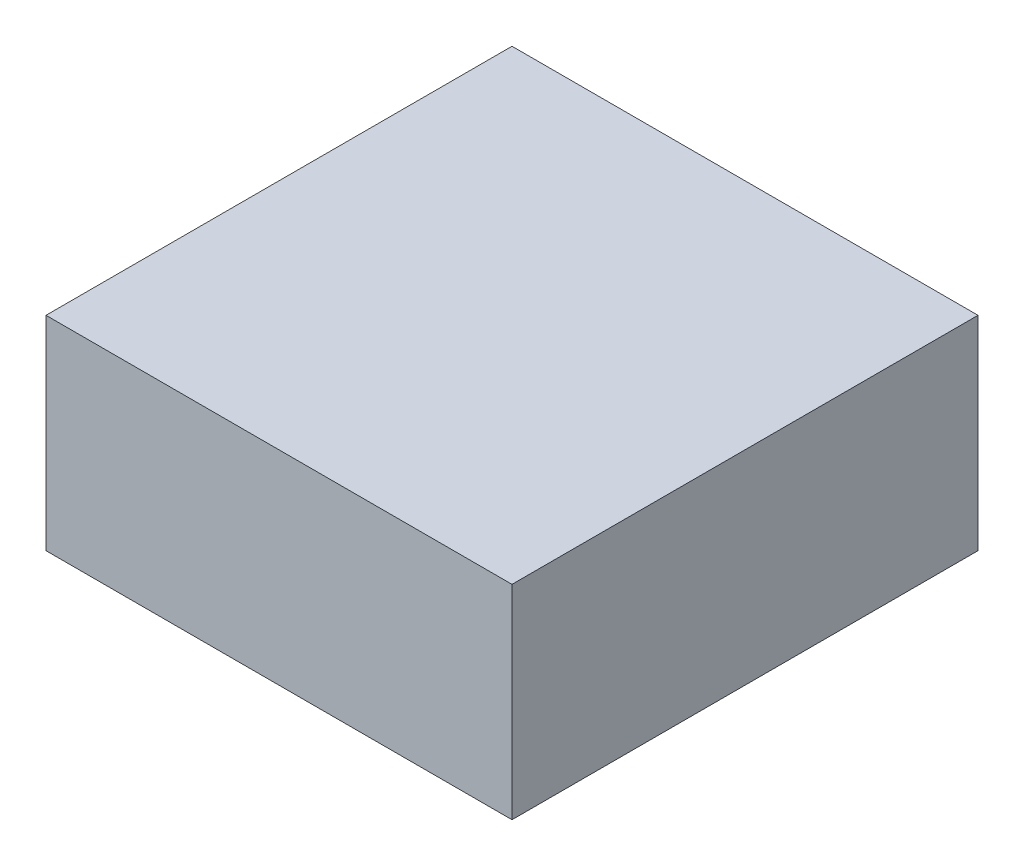
ISO-10303-21;
HEADER;
FILE_DESCRIPTION(('STEP AP214'),'2;1');
FILE_NAME('part.step','',(''),(''),'','','');
FILE_SCHEMA(('AUTOMOTIVE_DESIGN { 1 0 10303 214 1 1 1 1 }'));
ENDSEC;
DATA;
#1=APPLICATION_CONTEXT('core data for automotive mechanical design processes');
#2=APPLICATION_PROTOCOL_DEFINITION('international standard','automotive_design',2000,#1);
#3=PRODUCT_CONTEXT('',#1,'mechanical');
#4=PRODUCT('Part','Part','',(#3));
#5=PRODUCT_RELATED_PRODUCT_CATEGORY('part','',(#4));
#6=PRODUCT_DEFINITION_FORMATION('','',#4);
#7=PRODUCT_DEFINITION_CONTEXT('part definition',#1,'design');
#8=PRODUCT_DEFINITION('design','',#6,#7);
#9=PRODUCT_DEFINITION_SHAPE('','',#8);
#10=(LENGTH_UNIT() NAMED_UNIT(*) SI_UNIT(.MILLI.,.METRE.));
#11=(NAMED_UNIT(*) PLANE_ANGLE_UNIT() SI_UNIT($,.RADIAN.));
#12=(NAMED_UNIT(*) SI_UNIT($,.STERADIAN.) SOLID_ANGLE_UNIT());
#13=UNCERTAINTY_MEASURE_WITH_UNIT(LENGTH_MEASURE(1.E-05),#10,'distance_accuracy_value','');
#14=(GEOMETRIC_REPRESENTATION_CONTEXT(3) GLOBAL_UNCERTAINTY_ASSIGNED_CONTEXT((#13)) GLOBAL_UNIT_ASSIGNED_CONTEXT((#10,
#11,#12)) REPRESENTATION_CONTEXT('',''));
#15=CARTESIAN_POINT('',(0.,0.,0.));
#16=DIRECTION('',(0.,0.,1.));
#17=DIRECTION('',(1.,0.,0.));
#18=AXIS2_PLACEMENT_3D('',#15,#16,#17);
#19=CARTESIAN_POINT('',(0.40000174,0.17500092,0.));
#20=DIRECTION('',(0.,-1.,0.));
#21=DIRECTION('',(0.,0.,-1.));
#22=AXIS2_PLACEMENT_3D('',#19,#20,#21);
#23=PLANE('',#22);
#24=DIRECTION('',(0.,0.,-1.));
#25=VECTOR('',#24,1.);
#26=CARTESIAN_POINT('',(-0.3999992,0.17500092,0.));
#27=LINE('',#26,#25);
#28=CARTESIAN_POINT('',(-0.3999992,0.17500092,0.));
#29=VERTEX_POINT('',#28);
#30=CARTESIAN_POINT('',(-0.3999992,0.17500092,0.80000094));
#31=VERTEX_POINT('',#30);
#32=EDGE_CURVE('E20',#29,#31,#27,.F.);
#33=ORIENTED_EDGE('',*,*,#32,.T.);
#34=DIRECTION('',(-1.,0.,0.));
#35=VECTOR('',#34,1.);
#36=CARTESIAN_POINT('',(-0.3999992,0.17500092,0.80000094));
#37=LINE('',#36,#35);
#38=CARTESIAN_POINT('',(0.40000174,0.17500092,0.80000094));
#39=VERTEX_POINT('',#38);
#40=EDGE_CURVE('E55',#31,#39,#37,.F.);
#41=ORIENTED_EDGE('',*,*,#40,.T.);
#42=DIRECTION('',(0.,0.,1.));
#43=VECTOR('',#42,1.);
#44=CARTESIAN_POINT('',(0.40000174,0.17500092,0.));
#45=LINE('',#44,#43);
#46=CARTESIAN_POINT('',(0.40000174,0.17500092,0.));
#47=VERTEX_POINT('',#46);
#48=EDGE_CURVE('E76',#39,#47,#45,.F.);
#49=ORIENTED_EDGE('',*,*,#48,.T.);
#50=DIRECTION('',(-1.,0.,0.));
#51=VECTOR('',#50,1.);
#52=CARTESIAN_POINT('',(-0.3999992,0.17500092,0.));
#53=LINE('',#52,#51);
#54=EDGE_CURVE('E58',#29,#47,#53,.F.);
#55=ORIENTED_EDGE('',*,*,#54,.F.);
#56=EDGE_LOOP('',(#33,#41,#49,#55));
#57=FACE_BOUND('',#56,.T.);
#58=ADVANCED_FACE('F17',(#57),#23,.F.);
#59=CARTESIAN_POINT('',(-0.3999992,0.17500092,0.));
#60=DIRECTION('',(1.,0.,0.));
#61=DIRECTION('',(0.,0.,-1.));
#62=AXIS2_PLACEMENT_3D('',#59,#60,#61);
#63=PLANE('',#62);
#64=DIRECTION('',(0.,0.,1.));
#65=VECTOR('',#64,1.);
#66=CARTESIAN_POINT('',(-0.3999992,-0.17499838,0.));
#67=LINE('',#66,#65);
#68=CARTESIAN_POINT('',(-0.3999992,-0.17499838,0.));
#69=VERTEX_POINT('',#68);
#70=CARTESIAN_POINT('',(-0.3999992,-0.17499838,0.80000094));
#71=VERTEX_POINT('',#70);
#72=EDGE_CURVE('E73',#69,#71,#67,.T.);
#73=ORIENTED_EDGE('',*,*,#72,.T.);
#74=DIRECTION('',(0.,1.,0.));
#75=VECTOR('',#74,1.);
#76=CARTESIAN_POINT('',(-0.3999992,-0.17499838,0.80000094));
#77=LINE('',#76,#75);
#78=EDGE_CURVE('E63',#71,#31,#77,.T.);
#79=ORIENTED_EDGE('',*,*,#78,.T.);
#80=ORIENTED_EDGE('',*,*,#32,.F.);
#81=DIRECTION('',(0.,1.,0.));
#82=VECTOR('',#81,1.);
#83=CARTESIAN_POINT('',(-0.3999992,-0.17499838,0.));
#84=LINE('',#83,#82);
#85=EDGE_CURVE('E78',#69,#29,#84,.T.);
#86=ORIENTED_EDGE('',*,*,#85,.F.);
#87=EDGE_LOOP('',(#73,#79,#80,#86));
#88=FACE_BOUND('',#87,.T.);
#89=ADVANCED_FACE('F72',(#88),#63,.F.);
#90=CARTESIAN_POINT('',(-0.3999992,-0.17499838,0.80000094));
#91=DIRECTION('',(0.,0.,-1.));
#92=DIRECTION('',(-1.,0.,0.));
#93=AXIS2_PLACEMENT_3D('',#90,#91,#92);
#94=PLANE('',#93);
#95=DIRECTION('',(0.,1.,0.));
#96=VECTOR('',#95,1.);
#97=CARTESIAN_POINT('',(0.40000174,-0.17499838,0.80000094));
#98=LINE('',#97,#96);
#99=CARTESIAN_POINT('',(0.40000174,-0.17499838,0.80000094));
#100=VERTEX_POINT('',#99);
#101=EDGE_CURVE('E69',#100,#39,#98,.T.);
#102=ORIENTED_EDGE('',*,*,#101,.T.);
#103=ORIENTED_EDGE('',*,*,#40,.F.);
#104=ORIENTED_EDGE('',*,*,#78,.F.);
#105=DIRECTION('',(1.,0.,0.));
#106=VECTOR('',#105,1.);
#107=CARTESIAN_POINT('',(-0.3999992,-0.17499838,0.80000094));
#108=LINE('',#107,#106);
#109=EDGE_CURVE('E83',#71,#100,#108,.T.);
#110=ORIENTED_EDGE('',*,*,#109,.T.);
#111=EDGE_LOOP('',(#102,#103,#104,#110));
#112=FACE_BOUND('',#111,.T.);
#113=ADVANCED_FACE('F66',(#112),#94,.F.);
#114=CARTESIAN_POINT('',(0.40000174,-0.17499838,0.));
#115=DIRECTION('',(-1.,0.,0.));
#116=DIRECTION('',(0.,0.,1.));
#117=AXIS2_PLACEMENT_3D('',#114,#115,#116);
#118=PLANE('',#117);
#119=ORIENTED_EDGE('',*,*,#48,.F.);
#120=ORIENTED_EDGE('',*,*,#101,.F.);
#121=DIRECTION('',(0.,0.,1.));
#122=VECTOR('',#121,1.);
#123=CARTESIAN_POINT('',(0.40000174,-0.17499838,0.));
#124=LINE('',#123,#122);
#125=CARTESIAN_POINT('',(0.40000174,-0.17499838,0.));
#126=VERTEX_POINT('',#125);
#127=EDGE_CURVE('E26',#100,#126,#124,.F.);
#128=ORIENTED_EDGE('',*,*,#127,.T.);
#129=DIRECTION('',(0.,1.,0.));
#130=VECTOR('',#129,1.);
#131=CARTESIAN_POINT('',(0.40000174,-0.17499838,0.));
#132=LINE('',#131,#130);
#133=EDGE_CURVE('E34',#47,#126,#132,.F.);
#134=ORIENTED_EDGE('',*,*,#133,.F.);
#135=EDGE_LOOP('',(#119,#120,#128,#134));
#136=FACE_BOUND('',#135,.T.);
#137=ADVANCED_FACE('F88',(#136),#118,.F.);
#138=CARTESIAN_POINT('',(-0.3999992,-0.17499838,0.));
#139=DIRECTION('',(0.,0.,-1.));
#140=DIRECTION('',(-1.,0.,0.));
#141=AXIS2_PLACEMENT_3D('',#138,#139,#140);
#142=PLANE('',#141);
#143=ORIENTED_EDGE('',*,*,#133,.T.);
#144=DIRECTION('',(1.,0.,0.));
#145=VECTOR('',#144,1.);
#146=CARTESIAN_POINT('',(-0.3999992,-0.17499838,0.));
#147=LINE('',#146,#145);
#148=EDGE_CURVE('E11',#126,#69,#147,.F.);
#149=ORIENTED_EDGE('',*,*,#148,.T.);
#150=ORIENTED_EDGE('',*,*,#85,.T.);
#151=ORIENTED_EDGE('',*,*,#54,.T.);
#152=EDGE_LOOP('',(#143,#149,#150,#151));
#153=FACE_BOUND('',#152,.T.);
#154=ADVANCED_FACE('F91',(#153),#142,.T.);
#155=CARTESIAN_POINT('',(-0.3999992,-0.17499838,0.));
#156=DIRECTION('',(0.,1.,0.));
#157=DIRECTION('',(0.,0.,1.));
#158=AXIS2_PLACEMENT_3D('',#155,#156,#157);
#159=PLANE('',#158);
#160=ORIENTED_EDGE('',*,*,#127,.F.);
#161=ORIENTED_EDGE('',*,*,#109,.F.);
#162=ORIENTED_EDGE('',*,*,#72,.F.);
#163=ORIENTED_EDGE('',*,*,#148,.F.);
#164=EDGE_LOOP('',(#160,#161,#162,#163));
#165=FACE_BOUND('',#164,.T.);
#166=ADVANCED_FACE('F90',(#165),#159,.F.);
#167=CLOSED_SHELL('',(#58,#89,#113,#137,#154,#166));
#168=MANIFOLD_SOLID_BREP('B1',#167);
#169=ADVANCED_BREP_SHAPE_REPRESENTATION('',(#18,#168),#14);
#170=SHAPE_DEFINITION_REPRESENTATION(#9,#169);
ENDSEC;
END-ISO-10303-21;
